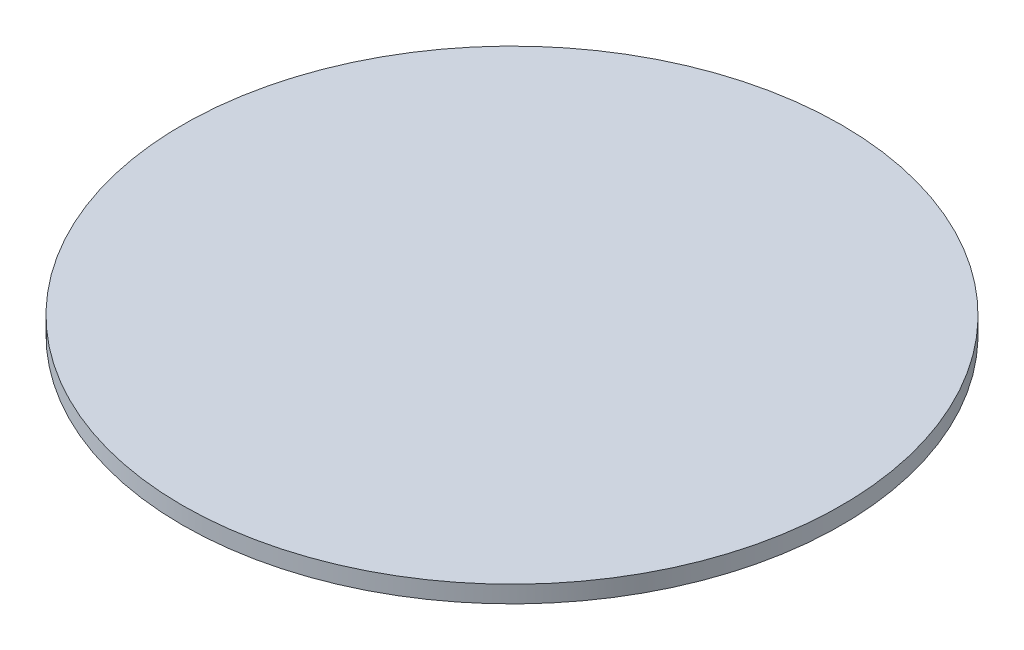
ISO-10303-21;
HEADER;
FILE_DESCRIPTION(('STEP AP214'),'2;1');
FILE_NAME('part.step','',(''),(''),'','','');
FILE_SCHEMA(('AUTOMOTIVE_DESIGN { 1 0 10303 214 1 1 1 1 }'));
ENDSEC;
DATA;
#1=APPLICATION_CONTEXT('core data for automotive mechanical design processes');
#2=APPLICATION_PROTOCOL_DEFINITION('international standard','automotive_design',2000,#1);
#3=PRODUCT_CONTEXT('',#1,'mechanical');
#4=PRODUCT('Part','Part','',(#3));
#5=PRODUCT_RELATED_PRODUCT_CATEGORY('part','',(#4));
#6=PRODUCT_DEFINITION_FORMATION('','',#4);
#7=PRODUCT_DEFINITION_CONTEXT('part definition',#1,'design');
#8=PRODUCT_DEFINITION('design','',#6,#7);
#9=PRODUCT_DEFINITION_SHAPE('','',#8);
#10=(LENGTH_UNIT() NAMED_UNIT(*) SI_UNIT(.MILLI.,.METRE.));
#11=(NAMED_UNIT(*) PLANE_ANGLE_UNIT() SI_UNIT($,.RADIAN.));
#12=(NAMED_UNIT(*) SI_UNIT($,.STERADIAN.) SOLID_ANGLE_UNIT());
#13=UNCERTAINTY_MEASURE_WITH_UNIT(LENGTH_MEASURE(1.E-05),#10,'distance_accuracy_value','');
#14=(GEOMETRIC_REPRESENTATION_CONTEXT(3) GLOBAL_UNCERTAINTY_ASSIGNED_CONTEXT((#13)) GLOBAL_UNIT_ASSIGNED_CONTEXT((#10,
#11,#12)) REPRESENTATION_CONTEXT('',''));
#15=CARTESIAN_POINT('',(0.,0.,0.));
#16=DIRECTION('',(0.,0.,1.));
#17=DIRECTION('',(1.,0.,0.));
#18=AXIS2_PLACEMENT_3D('',#15,#16,#17);
#19=CARTESIAN_POINT('',(0.,1.5,0.));
#20=DIRECTION('',(0.,-1.,0.));
#21=DIRECTION('',(0.,0.,-1.));
#22=AXIS2_PLACEMENT_3D('',#19,#20,#21);
#23=CYLINDRICAL_SURFACE('',#22,29.);
#24=CARTESIAN_POINT('',(0.,1.5,0.));
#25=DIRECTION('',(0.,1.,0.));
#26=DIRECTION('',(0.,0.,1.));
#27=AXIS2_PLACEMENT_3D('',#24,#25,#26);
#28=CIRCLE('',#27,29.);
#29=CARTESIAN_POINT('',(0.,1.5,29.));
#30=VERTEX_POINT('',#29);
#31=EDGE_CURVE('E10',#30,#30,#28,.T.);
#32=ORIENTED_EDGE('',*,*,#31,.F.);
#33=EDGE_LOOP('',(#32));
#34=FACE_BOUND('',#33,.T.);
#35=CARTESIAN_POINT('',(0.,0.,0.));
#36=DIRECTION('',(0.,1.,0.));
#37=DIRECTION('',(0.,0.,1.));
#38=AXIS2_PLACEMENT_3D('',#35,#36,#37);
#39=CIRCLE('',#38,29.);
#40=CARTESIAN_POINT('',(0.,0.,29.));
#41=VERTEX_POINT('',#40);
#42=EDGE_CURVE('E33',#41,#41,#39,.T.);
#43=ORIENTED_EDGE('',*,*,#42,.T.);
#44=EDGE_LOOP('',(#43));
#45=FACE_BOUND('',#44,.T.);
#46=ADVANCED_FACE('F30',(#34,#45),#23,.T.);
#47=CARTESIAN_POINT('',(0.,1.5,0.));
#48=DIRECTION('',(0.,1.,0.));
#49=DIRECTION('',(0.,0.,1.));
#50=AXIS2_PLACEMENT_3D('',#47,#48,#49);
#51=PLANE('',#50);
#52=ORIENTED_EDGE('',*,*,#31,.T.);
#53=EDGE_LOOP('',(#52));
#54=FACE_BOUND('',#53,.T.);
#55=ADVANCED_FACE('F45',(#54),#51,.T.);
#56=CARTESIAN_POINT('',(0.,0.,0.));
#57=DIRECTION('',(0.,1.,0.));
#58=DIRECTION('',(0.,0.,1.));
#59=AXIS2_PLACEMENT_3D('',#56,#57,#58);
#60=PLANE('',#59);
#61=ORIENTED_EDGE('',*,*,#42,.F.);
#62=EDGE_LOOP('',(#61));
#63=FACE_BOUND('',#62,.T.);
#64=ADVANCED_FACE('F43',(#63),#60,.F.);
#65=CLOSED_SHELL('',(#46,#55,#64));
#66=MANIFOLD_SOLID_BREP('B2',#65);
#67=ADVANCED_BREP_SHAPE_REPRESENTATION('',(#18,#66),#14);
#68=SHAPE_DEFINITION_REPRESENTATION(#9,#67);
ENDSEC;
END-ISO-10303-21;
